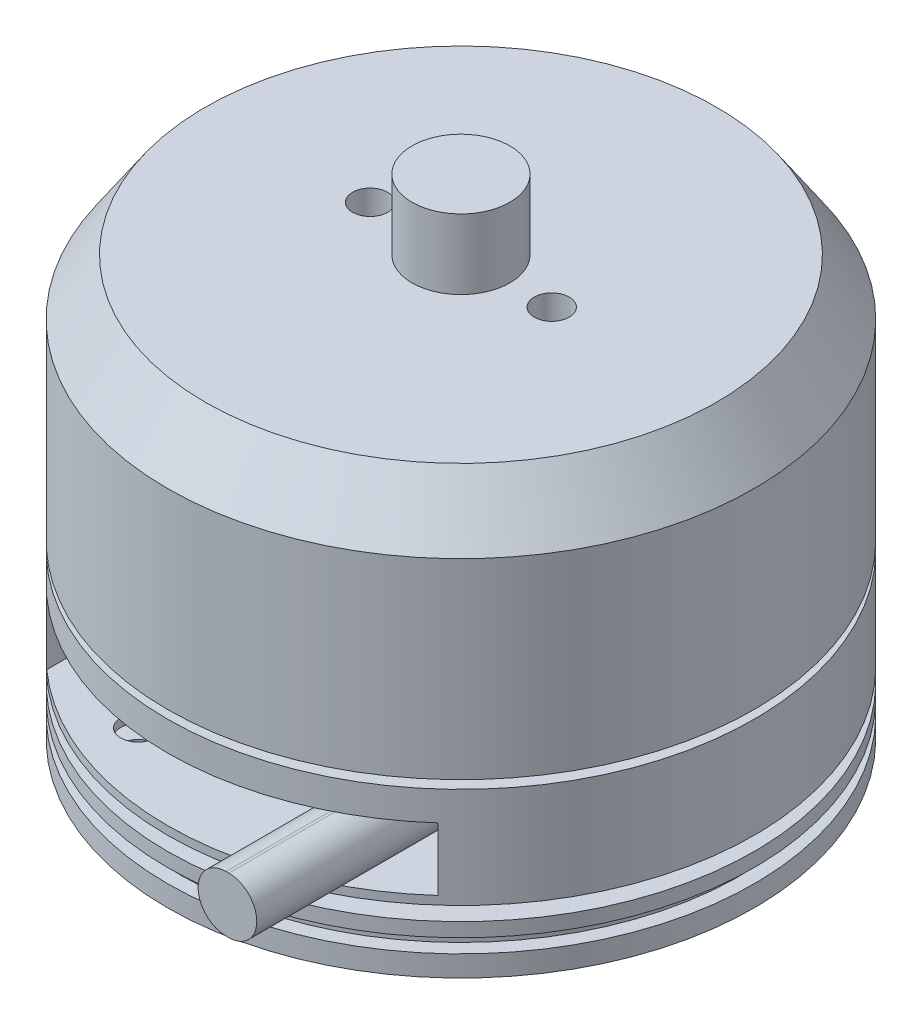
ISO-10303-21;
HEADER;
FILE_DESCRIPTION(('STEP AP214'),'2;1');
FILE_NAME('part.step','',(''),(''),'','','');
FILE_SCHEMA(('AUTOMOTIVE_DESIGN { 1 0 10303 214 1 1 1 1 }'));
ENDSEC;
DATA;
#1=APPLICATION_CONTEXT('core data for automotive mechanical design processes');
#2=APPLICATION_PROTOCOL_DEFINITION('international standard','automotive_design',2000,#1);
#3=PRODUCT_CONTEXT('',#1,'mechanical');
#4=PRODUCT('Part','Part','',(#3));
#5=PRODUCT_RELATED_PRODUCT_CATEGORY('part','',(#4));
#6=PRODUCT_DEFINITION_FORMATION('','',#4);
#7=PRODUCT_DEFINITION_CONTEXT('part definition',#1,'design');
#8=PRODUCT_DEFINITION('design','',#6,#7);
#9=PRODUCT_DEFINITION_SHAPE('','',#8);
#10=(LENGTH_UNIT() NAMED_UNIT(*) SI_UNIT(.MILLI.,.METRE.));
#11=(NAMED_UNIT(*) PLANE_ANGLE_UNIT() SI_UNIT($,.RADIAN.));
#12=(NAMED_UNIT(*) SI_UNIT($,.STERADIAN.) SOLID_ANGLE_UNIT());
#13=UNCERTAINTY_MEASURE_WITH_UNIT(LENGTH_MEASURE(1.E-05),#10,'distance_accuracy_value','');
#14=(GEOMETRIC_REPRESENTATION_CONTEXT(3) GLOBAL_UNCERTAINTY_ASSIGNED_CONTEXT((#13)) GLOBAL_UNIT_ASSIGNED_CONTEXT((#10,
#11,#12)) REPRESENTATION_CONTEXT('',''));
#15=CARTESIAN_POINT('',(0.,0.,0.));
#16=DIRECTION('',(0.,0.,1.));
#17=DIRECTION('',(1.,0.,0.));
#18=AXIS2_PLACEMENT_3D('',#15,#16,#17);
#19=CARTESIAN_POINT('',(0.,0.,11.));
#20=DIRECTION('',(0.,0.,1.));
#21=DIRECTION('',(1.,0.,0.));
#22=AXIS2_PLACEMENT_3D('',#19,#20,#21);
#23=PLANE('',#22);
#24=DIRECTION('',(0.,1.,0.));
#25=VECTOR('',#24,1.);
#26=CARTESIAN_POINT('',(14.,18.3,11.));
#27=LINE('',#26,#25);
#28=CARTESIAN_POINT('',(14.,13.8,11.));
#29=VERTEX_POINT('',#28);
#30=CARTESIAN_POINT('',(14.,18.3,11.));
#31=VERTEX_POINT('',#30);
#32=EDGE_CURVE('E161',#29,#31,#27,.T.);
#33=ORIENTED_EDGE('',*,*,#32,.T.);
#34=DIRECTION('',(-1.,0.,0.));
#35=VECTOR('',#34,1.);
#36=CARTESIAN_POINT('',(-14.,18.3,11.));
#37=LINE('',#36,#35);
#38=CARTESIAN_POINT('',(-14.,18.3,11.));
#39=VERTEX_POINT('',#38);
#40=EDGE_CURVE('E164',#31,#39,#37,.T.);
#41=ORIENTED_EDGE('',*,*,#40,.T.);
#42=DIRECTION('',(0.,-1.,0.));
#43=VECTOR('',#42,1.);
#44=CARTESIAN_POINT('',(-14.,18.3,11.));
#45=LINE('',#44,#43);
#46=CARTESIAN_POINT('',(-14.,13.8,11.));
#47=VERTEX_POINT('',#46);
#48=EDGE_CURVE('E167',#39,#47,#45,.T.);
#49=ORIENTED_EDGE('',*,*,#48,.T.);
#50=DIRECTION('',(1.,0.,0.));
#51=VECTOR('',#50,1.);
#52=CARTESIAN_POINT('',(-14.,13.8,11.));
#53=LINE('',#52,#51);
#54=EDGE_CURVE('E170',#47,#29,#53,.T.);
#55=ORIENTED_EDGE('',*,*,#54,.T.);
#56=EDGE_LOOP('',(#33,#41,#49,#55));
#57=FACE_BOUND('',#56,.T.);
#58=DIRECTION('',(1.,0.,0.));
#59=VECTOR('',#58,1.);
#60=CARTESIAN_POINT('',(9.18505632343501,14.0531944170925,11.));
#61=LINE('',#60,#59);
#62=CARTESIAN_POINT('',(9.18505632343501,14.0531944170925,11.));
#63=VERTEX_POINT('',#62);
#64=CARTESIAN_POINT('',(9.38505632343501,14.0531944170925,11.));
#65=VERTEX_POINT('',#64);
#66=EDGE_CURVE('E148',#63,#65,#61,.T.);
#67=ORIENTED_EDGE('',*,*,#66,.F.);
#68=CARTESIAN_POINT('',(9.18505632343501,16.0531944170925,11.));
#69=DIRECTION('',(0.,0.,1.));
#70=DIRECTION('',(1.,0.,0.));
#71=AXIS2_PLACEMENT_3D('',#68,#69,#70);
#72=CIRCLE('',#71,1.99999999999999);
#73=CARTESIAN_POINT('',(9.18505632343501,18.0531944170925,11.));
#74=VERTEX_POINT('',#73);
#75=EDGE_CURVE('E134',#74,#63,#72,.T.);
#76=ORIENTED_EDGE('',*,*,#75,.F.);
#77=DIRECTION('',(-1.,0.,0.));
#78=VECTOR('',#77,1.);
#79=CARTESIAN_POINT('',(9.18505632343501,18.0531944170925,11.));
#80=LINE('',#79,#78);
#81=CARTESIAN_POINT('',(9.38505632343501,18.0531944170925,11.));
#82=VERTEX_POINT('',#81);
#83=EDGE_CURVE('E139',#82,#74,#80,.T.);
#84=ORIENTED_EDGE('',*,*,#83,.F.);
#85=CARTESIAN_POINT('',(9.38505632343501,16.0531944170925,11.));
#86=DIRECTION('',(0.,0.,1.));
#87=DIRECTION('',(1.,0.,0.));
#88=AXIS2_PLACEMENT_3D('',#85,#86,#87);
#89=CIRCLE('',#88,2.);
#90=EDGE_CURVE('E150',#65,#82,#89,.T.);
#91=ORIENTED_EDGE('',*,*,#90,.F.);
#92=EDGE_LOOP('',(#67,#76,#84,#91));
#93=FACE_BOUND('',#92,.T.);
#94=ADVANCED_FACE('F38',(#57,#93),#23,.T.);
#95=CARTESIAN_POINT('',(0.,43.7,0.));
#96=DIRECTION('',(0.,1.,0.));
#97=DIRECTION('',(0.,0.,1.));
#98=AXIS2_PLACEMENT_3D('',#95,#96,#97);
#99=CYLINDRICAL_SURFACE('',#98,21.);
#100=CARTESIAN_POINT('',(0.,10.2,0.));
#101=DIRECTION('',(0.,1.,0.));
#102=DIRECTION('',(0.,0.,1.));
#103=AXIS2_PLACEMENT_3D('',#100,#101,#102);
#104=CIRCLE('',#103,21.);
#105=CARTESIAN_POINT('',(0.,10.2,21.));
#106=VERTEX_POINT('',#105);
#107=EDGE_CURVE('E228',#106,#106,#104,.T.);
#108=ORIENTED_EDGE('',*,*,#107,.F.);
#109=EDGE_LOOP('',(#108));
#110=FACE_BOUND('',#109,.T.);
#111=CARTESIAN_POINT('',(0.,8.69999999999999,0.));
#112=DIRECTION('',(0.,1.,0.));
#113=DIRECTION('',(0.,0.,1.));
#114=AXIS2_PLACEMENT_3D('',#111,#112,#113);
#115=CIRCLE('',#114,21.);
#116=CARTESIAN_POINT('',(0.,8.69999999999999,21.));
#117=VERTEX_POINT('',#116);
#118=EDGE_CURVE('E42',#117,#117,#115,.T.);
#119=ORIENTED_EDGE('',*,*,#118,.T.);
#120=EDGE_LOOP('',(#119));
#121=FACE_BOUND('',#120,.T.);
#122=ADVANCED_FACE('F40',(#110,#121),#99,.T.);
#123=CARTESIAN_POINT('',(21.,10.2,0.));
#124=DIRECTION('',(0.,-1.,0.));
#125=DIRECTION('',(0.,0.,-1.));
#126=AXIS2_PLACEMENT_3D('',#123,#124,#125);
#127=PLANE('',#126);
#128=CARTESIAN_POINT('',(0.,10.2,0.));
#129=DIRECTION('',(0.,1.,0.));
#130=DIRECTION('',(0.,0.,1.));
#131=AXIS2_PLACEMENT_3D('',#128,#129,#130);
#132=CIRCLE('',#131,20.);
#133=CARTESIAN_POINT('',(0.,10.2,20.));
#134=VERTEX_POINT('',#133);
#135=EDGE_CURVE('E225',#134,#134,#132,.T.);
#136=ORIENTED_EDGE('',*,*,#135,.F.);
#137=EDGE_LOOP('',(#136));
#138=FACE_BOUND('',#137,.T.);
#139=ORIENTED_EDGE('',*,*,#107,.T.);
#140=EDGE_LOOP('',(#139));
#141=FACE_BOUND('',#140,.T.);
#142=ADVANCED_FACE('F351',(#138,#141),#127,.F.);
#143=CARTESIAN_POINT('',(0.,43.7,0.));
#144=DIRECTION('',(0.,1.,0.));
#145=DIRECTION('',(0.,0.,1.));
#146=AXIS2_PLACEMENT_3D('',#143,#144,#145);
#147=CYLINDRICAL_SURFACE('',#146,20.);
#148=CARTESIAN_POINT('',(0.,11.2,0.));
#149=DIRECTION('',(0.,1.,0.));
#150=DIRECTION('',(0.,0.,1.));
#151=AXIS2_PLACEMENT_3D('',#148,#149,#150);
#152=CIRCLE('',#151,20.);
#153=CARTESIAN_POINT('',(0.,11.2,20.));
#154=VERTEX_POINT('',#153);
#155=EDGE_CURVE('E222',#154,#154,#152,.T.);
#156=ORIENTED_EDGE('',*,*,#155,.F.);
#157=EDGE_LOOP('',(#156));
#158=FACE_BOUND('',#157,.T.);
#159=ORIENTED_EDGE('',*,*,#135,.T.);
#160=EDGE_LOOP('',(#159));
#161=FACE_BOUND('',#160,.T.);
#162=ADVANCED_FACE('F345',(#158,#161),#147,.T.);
#163=CARTESIAN_POINT('',(20.,11.2,0.));
#164=DIRECTION('',(0.,1.,0.));
#165=DIRECTION('',(0.,0.,1.));
#166=AXIS2_PLACEMENT_3D('',#163,#164,#165);
#167=PLANE('',#166);
#168=CARTESIAN_POINT('',(0.,11.2,0.));
#169=DIRECTION('',(0.,1.,0.));
#170=DIRECTION('',(0.,0.,1.));
#171=AXIS2_PLACEMENT_3D('',#168,#169,#170);
#172=CIRCLE('',#171,21.);
#173=CARTESIAN_POINT('',(0.,11.2,21.));
#174=VERTEX_POINT('',#173);
#175=EDGE_CURVE('E219',#174,#174,#172,.T.);
#176=ORIENTED_EDGE('',*,*,#175,.F.);
#177=EDGE_LOOP('',(#176));
#178=FACE_BOUND('',#177,.T.);
#179=ORIENTED_EDGE('',*,*,#155,.T.);
#180=EDGE_LOOP('',(#179));
#181=FACE_BOUND('',#180,.T.);
#182=ADVANCED_FACE('F339',(#178,#181),#167,.F.);
#183=CARTESIAN_POINT('',(0.,43.7,0.));
#184=DIRECTION('',(0.,1.,0.));
#185=DIRECTION('',(0.,0.,1.));
#186=AXIS2_PLACEMENT_3D('',#183,#184,#185);
#187=CYLINDRICAL_SURFACE('',#186,21.);
#188=CARTESIAN_POINT('',(0.,12.2,0.));
#189=DIRECTION('',(0.,1.,0.));
#190=DIRECTION('',(0.,0.,1.));
#191=AXIS2_PLACEMENT_3D('',#188,#189,#190);
#192=CIRCLE('',#191,21.);
#193=CARTESIAN_POINT('',(0.,12.2,21.));
#194=VERTEX_POINT('',#193);
#195=EDGE_CURVE('E216',#194,#194,#192,.T.);
#196=ORIENTED_EDGE('',*,*,#195,.F.);
#197=EDGE_LOOP('',(#196));
#198=FACE_BOUND('',#197,.T.);
#199=ORIENTED_EDGE('',*,*,#175,.T.);
#200=EDGE_LOOP('',(#199));
#201=FACE_BOUND('',#200,.T.);
#202=ADVANCED_FACE('F330',(#198,#201),#187,.T.);
#203=CARTESIAN_POINT('',(21.,12.2,0.));
#204=DIRECTION('',(0.,-1.,0.));
#205=DIRECTION('',(0.,0.,-1.));
#206=AXIS2_PLACEMENT_3D('',#203,#204,#205);
#207=PLANE('',#206);
#208=CARTESIAN_POINT('',(-7.1178912538264,12.2,15.9870455087456));
#209=DIRECTION('',(0.,-1.,0.));
#210=DIRECTION('',(0.,0.,-1.));
#211=AXIS2_PLACEMENT_3D('',#208,#209,#210);
#212=CIRCLE('',#211,1.25);
#213=CARTESIAN_POINT('',(-7.1178912538264,12.2,14.7370455087456));
#214=VERTEX_POINT('',#213);
#215=EDGE_CURVE('E252',#214,#214,#212,.T.);
#216=ORIENTED_EDGE('',*,*,#215,.T.);
#217=EDGE_LOOP('',(#216));
#218=FACE_BOUND('',#217,.T.);
#219=CARTESIAN_POINT('',(15.9870455087456,12.2,7.11789125382641));
#220=DIRECTION('',(0.,-1.,0.));
#221=DIRECTION('',(0.,0.,-1.));
#222=AXIS2_PLACEMENT_3D('',#219,#220,#221);
#223=CIRCLE('',#222,1.25);
#224=CARTESIAN_POINT('',(15.9870455087456,12.2,5.86789125382641));
#225=VERTEX_POINT('',#224);
#226=EDGE_CURVE('E261',#225,#225,#223,.T.);
#227=ORIENTED_EDGE('',*,*,#226,.T.);
#228=EDGE_LOOP('',(#227));
#229=FACE_BOUND('',#228,.T.);
#230=CARTESIAN_POINT('',(7.11789125382642,12.2,-15.9870455087456));
#231=DIRECTION('',(0.,-1.,0.));
#232=DIRECTION('',(0.,0.,-1.));
#233=AXIS2_PLACEMENT_3D('',#230,#231,#232);
#234=CIRCLE('',#233,1.25);
#235=CARTESIAN_POINT('',(7.11789125382642,12.2,-17.2370455087456));
#236=VERTEX_POINT('',#235);
#237=EDGE_CURVE('E267',#236,#236,#234,.T.);
#238=ORIENTED_EDGE('',*,*,#237,.T.);
#239=EDGE_LOOP('',(#238));
#240=FACE_BOUND('',#239,.T.);
#241=CARTESIAN_POINT('',(-15.9870455087455,12.2,-7.11789125382641));
#242=DIRECTION('',(0.,-1.,0.));
#243=DIRECTION('',(0.,0.,-1.));
#244=AXIS2_PLACEMENT_3D('',#241,#242,#243);
#245=CIRCLE('',#244,1.25);
#246=CARTESIAN_POINT('',(-15.9870455087455,12.2,-8.36789125382641));
#247=VERTEX_POINT('',#246);
#248=EDGE_CURVE('E273',#247,#247,#245,.T.);
#249=ORIENTED_EDGE('',*,*,#248,.T.);
#250=EDGE_LOOP('',(#249));
#251=FACE_BOUND('',#250,.T.);
#252=CARTESIAN_POINT('',(0.,12.2,0.));
#253=DIRECTION('',(0.,1.,0.));
#254=DIRECTION('',(0.,0.,1.));
#255=AXIS2_PLACEMENT_3D('',#252,#253,#254);
#256=CIRCLE('',#255,10.);
#257=CARTESIAN_POINT('',(0.,12.2,10.));
#258=VERTEX_POINT('',#257);
#259=EDGE_CURVE('E213',#258,#258,#256,.T.);
#260=ORIENTED_EDGE('',*,*,#259,.F.);
#261=EDGE_LOOP('',(#260));
#262=FACE_BOUND('',#261,.T.);
#263=ORIENTED_EDGE('',*,*,#195,.T.);
#264=EDGE_LOOP('',(#263));
#265=FACE_BOUND('',#264,.T.);
#266=ADVANCED_FACE('F326',(#218,#229,#240,#251,#262,#265),#207,.F.);
#267=CARTESIAN_POINT('',(0.,43.7,0.));
#268=DIRECTION('',(0.,1.,0.));
#269=DIRECTION('',(0.,0.,1.));
#270=AXIS2_PLACEMENT_3D('',#267,#268,#269);
#271=CYLINDRICAL_SURFACE('',#270,10.);
#272=CARTESIAN_POINT('',(0.,13.2,0.));
#273=DIRECTION('',(0.,1.,0.));
#274=DIRECTION('',(0.,0.,1.));
#275=AXIS2_PLACEMENT_3D('',#272,#273,#274);
#276=CIRCLE('',#275,10.);
#277=CARTESIAN_POINT('',(0.,13.2,10.));
#278=VERTEX_POINT('',#277);
#279=EDGE_CURVE('E210',#278,#278,#276,.T.);
#280=ORIENTED_EDGE('',*,*,#279,.F.);
#281=EDGE_LOOP('',(#280));
#282=FACE_BOUND('',#281,.T.);
#283=ORIENTED_EDGE('',*,*,#259,.T.);
#284=EDGE_LOOP('',(#283));
#285=FACE_BOUND('',#284,.T.);
#286=ADVANCED_FACE('F329',(#282,#285),#271,.T.);
#287=CARTESIAN_POINT('',(10.,13.2,0.));
#288=DIRECTION('',(0.,1.,0.));
#289=DIRECTION('',(0.,0.,1.));
#290=AXIS2_PLACEMENT_3D('',#287,#288,#289);
#291=PLANE('',#290);
#292=CARTESIAN_POINT('',(-7.1178912538264,13.2,15.9870455087456));
#293=DIRECTION('',(0.,1.,0.));
#294=DIRECTION('',(0.,0.,1.));
#295=AXIS2_PLACEMENT_3D('',#292,#293,#294);
#296=CIRCLE('',#295,1.25);
#297=CARTESIAN_POINT('',(-7.1178912538264,13.2,17.2370455087456));
#298=VERTEX_POINT('',#297);
#299=EDGE_CURVE('E255',#298,#298,#296,.T.);
#300=ORIENTED_EDGE('',*,*,#299,.T.);
#301=EDGE_LOOP('',(#300));
#302=FACE_BOUND('',#301,.T.);
#303=CARTESIAN_POINT('',(15.9870455087456,13.2,7.11789125382641));
#304=DIRECTION('',(0.,1.,0.));
#305=DIRECTION('',(0.,0.,1.));
#306=AXIS2_PLACEMENT_3D('',#303,#304,#305);
#307=CIRCLE('',#306,1.25);
#308=CARTESIAN_POINT('',(15.9870455087456,13.2,8.36789125382641));
#309=VERTEX_POINT('',#308);
#310=EDGE_CURVE('E264',#309,#309,#307,.T.);
#311=ORIENTED_EDGE('',*,*,#310,.T.);
#312=EDGE_LOOP('',(#311));
#313=FACE_BOUND('',#312,.T.);
#314=CARTESIAN_POINT('',(7.11789125382642,13.2,-15.9870455087456));
#315=DIRECTION('',(0.,1.,0.));
#316=DIRECTION('',(0.,0.,1.));
#317=AXIS2_PLACEMENT_3D('',#314,#315,#316);
#318=CIRCLE('',#317,1.25);
#319=CARTESIAN_POINT('',(7.11789125382642,13.2,-14.7370455087455));
#320=VERTEX_POINT('',#319);
#321=EDGE_CURVE('E270',#320,#320,#318,.T.);
#322=ORIENTED_EDGE('',*,*,#321,.T.);
#323=EDGE_LOOP('',(#322));
#324=FACE_BOUND('',#323,.T.);
#325=CARTESIAN_POINT('',(-15.9870455087455,13.2,-7.11789125382641));
#326=DIRECTION('',(0.,1.,0.));
#327=DIRECTION('',(0.,0.,1.));
#328=AXIS2_PLACEMENT_3D('',#325,#326,#327);
#329=CIRCLE('',#328,1.25);
#330=CARTESIAN_POINT('',(-15.9870455087455,13.2,-5.86789125382641));
#331=VERTEX_POINT('',#330);
#332=EDGE_CURVE('E276',#331,#331,#329,.T.);
#333=ORIENTED_EDGE('',*,*,#332,.T.);
#334=EDGE_LOOP('',(#333));
#335=FACE_BOUND('',#334,.T.);
#336=CARTESIAN_POINT('',(0.,13.2,0.));
#337=DIRECTION('',(0.,1.,0.));
#338=DIRECTION('',(0.,0.,1.));
#339=AXIS2_PLACEMENT_3D('',#336,#337,#338);
#340=CIRCLE('',#339,21.);
#341=CARTESIAN_POINT('',(0.,13.2,21.));
#342=VERTEX_POINT('',#341);
#343=EDGE_CURVE('E207',#342,#342,#340,.T.);
#344=ORIENTED_EDGE('',*,*,#343,.F.);
#345=EDGE_LOOP('',(#344));
#346=FACE_BOUND('',#345,.T.);
#347=ORIENTED_EDGE('',*,*,#279,.T.);
#348=EDGE_LOOP('',(#347));
#349=FACE_BOUND('',#348,.T.);
#350=ADVANCED_FACE('F423',(#302,#313,#324,#335,#346,#349),#291,.F.);
#351=CARTESIAN_POINT('',(0.,43.7,0.));
#352=DIRECTION('',(0.,1.,0.));
#353=DIRECTION('',(0.,0.,1.));
#354=AXIS2_PLACEMENT_3D('',#351,#352,#353);
#355=CYLINDRICAL_SURFACE('',#354,21.);
#356=CARTESIAN_POINT('',(0.,18.3,0.));
#357=DIRECTION('',(0.,1.,0.));
#358=DIRECTION('',(0.,0.,1.));
#359=AXIS2_PLACEMENT_3D('',#356,#357,#358);
#360=CIRCLE('',#359,21.);
#361=CARTESIAN_POINT('',(-14.,18.3,15.6524758424985));
#362=VERTEX_POINT('',#361);
#363=CARTESIAN_POINT('',(14.,18.3,15.6524758424985));
#364=VERTEX_POINT('',#363);
#365=EDGE_CURVE('E231',#362,#364,#360,.T.);
#366=ORIENTED_EDGE('',*,*,#365,.T.);
#367=DIRECTION('',(0.,1.,0.));
#368=VECTOR('',#367,1.);
#369=CARTESIAN_POINT('',(14.,43.7,15.6524758424985));
#370=LINE('',#369,#368);
#371=CARTESIAN_POINT('',(14.,13.8,15.6524758424985));
#372=VERTEX_POINT('',#371);
#373=EDGE_CURVE('E236',#364,#372,#370,.F.);
#374=ORIENTED_EDGE('',*,*,#373,.T.);
#375=CARTESIAN_POINT('',(0.,13.8,0.));
#376=DIRECTION('',(0.,-1.,0.));
#377=DIRECTION('',(0.,0.,-1.));
#378=AXIS2_PLACEMENT_3D('',#375,#376,#377);
#379=CIRCLE('',#378,21.);
#380=CARTESIAN_POINT('',(-14.,13.8,15.6524758424985));
#381=VERTEX_POINT('',#380);
#382=EDGE_CURVE('E63',#372,#381,#379,.T.);
#383=ORIENTED_EDGE('',*,*,#382,.T.);
#384=DIRECTION('',(0.,1.,0.));
#385=VECTOR('',#384,1.);
#386=CARTESIAN_POINT('',(-14.,43.7,15.6524758424985));
#387=LINE('',#386,#385);
#388=EDGE_CURVE('E233',#381,#362,#387,.T.);
#389=ORIENTED_EDGE('',*,*,#388,.T.);
#390=EDGE_LOOP('',(#366,#374,#383,#389));
#391=FACE_BOUND('',#390,.T.);
#392=CARTESIAN_POINT('',(0.,20.4,0.));
#393=DIRECTION('',(0.,1.,0.));
#394=DIRECTION('',(0.,0.,1.));
#395=AXIS2_PLACEMENT_3D('',#392,#393,#394);
#396=CIRCLE('',#395,21.);
#397=CARTESIAN_POINT('',(0.,20.4,21.));
#398=VERTEX_POINT('',#397);
#399=EDGE_CURVE('E204',#398,#398,#396,.T.);
#400=ORIENTED_EDGE('',*,*,#399,.F.);
#401=EDGE_LOOP('',(#400));
#402=FACE_BOUND('',#401,.T.);
#403=ORIENTED_EDGE('',*,*,#343,.T.);
#404=EDGE_LOOP('',(#403));
#405=FACE_BOUND('',#404,.T.);
#406=ADVANCED_FACE('F419',(#391,#402,#405),#355,.T.);
#407=CARTESIAN_POINT('',(21.,20.4,0.));
#408=DIRECTION('',(0.,-1.,0.));
#409=DIRECTION('',(0.,0.,-1.));
#410=AXIS2_PLACEMENT_3D('',#407,#408,#409);
#411=PLANE('',#410);
#412=CARTESIAN_POINT('',(0.,20.4,0.));
#413=DIRECTION('',(0.,1.,0.));
#414=DIRECTION('',(0.,0.,1.));
#415=AXIS2_PLACEMENT_3D('',#412,#413,#414);
#416=CIRCLE('',#415,5.);
#417=CARTESIAN_POINT('',(0.,20.4,5.));
#418=VERTEX_POINT('',#417);
#419=EDGE_CURVE('E201',#418,#418,#416,.T.);
#420=ORIENTED_EDGE('',*,*,#419,.F.);
#421=EDGE_LOOP('',(#420));
#422=FACE_BOUND('',#421,.T.);
#423=ORIENTED_EDGE('',*,*,#399,.T.);
#424=EDGE_LOOP('',(#423));
#425=FACE_BOUND('',#424,.T.);
#426=ADVANCED_FACE('F415',(#422,#425),#411,.F.);
#427=CARTESIAN_POINT('',(0.,43.7,0.));
#428=DIRECTION('',(0.,1.,0.));
#429=DIRECTION('',(0.,0.,1.));
#430=AXIS2_PLACEMENT_3D('',#427,#428,#429);
#431=CYLINDRICAL_SURFACE('',#430,5.);
#432=CARTESIAN_POINT('',(0.,21.,0.));
#433=DIRECTION('',(0.,1.,0.));
#434=DIRECTION('',(0.,0.,1.));
#435=AXIS2_PLACEMENT_3D('',#432,#433,#434);
#436=CIRCLE('',#435,5.);
#437=CARTESIAN_POINT('',(0.,21.,5.));
#438=VERTEX_POINT('',#437);
#439=EDGE_CURVE('E198',#438,#438,#436,.T.);
#440=ORIENTED_EDGE('',*,*,#439,.F.);
#441=EDGE_LOOP('',(#440));
#442=FACE_BOUND('',#441,.T.);
#443=ORIENTED_EDGE('',*,*,#419,.T.);
#444=EDGE_LOOP('',(#443));
#445=FACE_BOUND('',#444,.T.);
#446=ADVANCED_FACE('F411',(#442,#445),#431,.T.);
#447=CARTESIAN_POINT('',(5.,21.,0.));
#448=DIRECTION('',(0.,1.,0.));
#449=DIRECTION('',(0.,0.,1.));
#450=AXIS2_PLACEMENT_3D('',#447,#448,#449);
#451=PLANE('',#450);
#452=CARTESIAN_POINT('',(0.,21.,0.));
#453=DIRECTION('',(0.,1.,0.));
#454=DIRECTION('',(0.,0.,1.));
#455=AXIS2_PLACEMENT_3D('',#452,#453,#454);
#456=CIRCLE('',#455,21.);
#457=CARTESIAN_POINT('',(0.,21.,21.));
#458=VERTEX_POINT('',#457);
#459=EDGE_CURVE('E195',#458,#458,#456,.T.);
#460=ORIENTED_EDGE('',*,*,#459,.F.);
#461=EDGE_LOOP('',(#460));
#462=FACE_BOUND('',#461,.T.);
#463=ORIENTED_EDGE('',*,*,#439,.T.);
#464=EDGE_LOOP('',(#463));
#465=FACE_BOUND('',#464,.T.);
#466=ADVANCED_FACE('F407',(#462,#465),#451,.F.);
#467=CARTESIAN_POINT('',(0.,43.7,0.));
#468=DIRECTION('',(0.,1.,0.));
#469=DIRECTION('',(0.,0.,1.));
#470=AXIS2_PLACEMENT_3D('',#467,#468,#469);
#471=CYLINDRICAL_SURFACE('',#470,21.);
#472=CARTESIAN_POINT('',(0.,34.7,0.));
#473=DIRECTION('',(0.,1.,0.));
#474=DIRECTION('',(0.,0.,1.));
#475=AXIS2_PLACEMENT_3D('',#472,#473,#474);
#476=CIRCLE('',#475,21.);
#477=CARTESIAN_POINT('',(0.,34.7,21.));
#478=VERTEX_POINT('',#477);
#479=EDGE_CURVE('E192',#478,#478,#476,.T.);
#480=ORIENTED_EDGE('',*,*,#479,.F.);
#481=EDGE_LOOP('',(#480));
#482=FACE_BOUND('',#481,.T.);
#483=ORIENTED_EDGE('',*,*,#459,.T.);
#484=EDGE_LOOP('',(#483));
#485=FACE_BOUND('',#484,.T.);
#486=ADVANCED_FACE('F403',(#482,#485),#471,.T.);
#487=CARTESIAN_POINT('',(0.,34.7,0.));
#488=DIRECTION('',(0.,-1.,0.));
#489=DIRECTION('',(0.,0.,-1.));
#490=AXIS2_PLACEMENT_3D('',#487,#488,#489);
#491=CONICAL_SURFACE('',#490,21.,0.593749666710772);
#492=CARTESIAN_POINT('',(0.,38.7,0.));
#493=DIRECTION('',(0.,1.,0.));
#494=DIRECTION('',(0.,0.,1.));
#495=AXIS2_PLACEMENT_3D('',#492,#493,#494);
#496=CIRCLE('',#495,18.3);
#497=CARTESIAN_POINT('',(0.,38.7,18.3));
#498=VERTEX_POINT('',#497);
#499=EDGE_CURVE('E189',#498,#498,#496,.T.);
#500=ORIENTED_EDGE('',*,*,#499,.F.);
#501=EDGE_LOOP('',(#500));
#502=FACE_BOUND('',#501,.T.);
#503=ORIENTED_EDGE('',*,*,#479,.T.);
#504=EDGE_LOOP('',(#503));
#505=FACE_BOUND('',#504,.T.);
#506=ADVANCED_FACE('F399',(#502,#505),#491,.T.);
#507=CARTESIAN_POINT('',(18.3,38.7,0.));
#508=DIRECTION('',(0.,-1.,0.));
#509=DIRECTION('',(0.,0.,-1.));
#510=AXIS2_PLACEMENT_3D('',#507,#508,#509);
#511=PLANE('',#510);
#512=CARTESIAN_POINT('',(-6.5,38.7,0.));
#513=DIRECTION('',(0.,1.,0.));
#514=DIRECTION('',(0.,0.,1.));
#515=AXIS2_PLACEMENT_3D('',#512,#513,#514);
#516=CIRCLE('',#515,1.24999999999999);
#517=CARTESIAN_POINT('',(-6.5,38.7,1.24999999999999));
#518=VERTEX_POINT('',#517);
#519=EDGE_CURVE('E122',#518,#518,#516,.T.);
#520=ORIENTED_EDGE('',*,*,#519,.F.);
#521=EDGE_LOOP('',(#520));
#522=FACE_BOUND('',#521,.T.);
#523=CARTESIAN_POINT('',(6.5,38.7,0.));
#524=DIRECTION('',(0.,1.,0.));
#525=DIRECTION('',(0.,0.,1.));
#526=AXIS2_PLACEMENT_3D('',#523,#524,#525);
#527=CIRCLE('',#526,1.24999999999999);
#528=CARTESIAN_POINT('',(6.5,38.7,1.24999999999999));
#529=VERTEX_POINT('',#528);
#530=EDGE_CURVE('E121',#529,#529,#527,.T.);
#531=ORIENTED_EDGE('',*,*,#530,.F.);
#532=EDGE_LOOP('',(#531));
#533=FACE_BOUND('',#532,.T.);
#534=CARTESIAN_POINT('',(0.,38.7,0.));
#535=DIRECTION('',(0.,1.,0.));
#536=DIRECTION('',(0.,0.,1.));
#537=AXIS2_PLACEMENT_3D('',#534,#535,#536);
#538=CIRCLE('',#537,3.5);
#539=CARTESIAN_POINT('',(0.,38.7,3.5));
#540=VERTEX_POINT('',#539);
#541=EDGE_CURVE('E186',#540,#540,#538,.T.);
#542=ORIENTED_EDGE('',*,*,#541,.F.);
#543=EDGE_LOOP('',(#542));
#544=FACE_BOUND('',#543,.T.);
#545=ORIENTED_EDGE('',*,*,#499,.T.);
#546=EDGE_LOOP('',(#545));
#547=FACE_BOUND('',#546,.T.);
#548=ADVANCED_FACE('F395',(#522,#533,#544,#547),#511,.F.);
#549=CARTESIAN_POINT('',(0.,43.7,0.));
#550=DIRECTION('',(0.,1.,0.));
#551=DIRECTION('',(0.,0.,1.));
#552=AXIS2_PLACEMENT_3D('',#549,#550,#551);
#553=CYLINDRICAL_SURFACE('',#552,3.5);
#554=CARTESIAN_POINT('',(0.,43.7,0.));
#555=DIRECTION('',(0.,1.,0.));
#556=DIRECTION('',(0.,0.,1.));
#557=AXIS2_PLACEMENT_3D('',#554,#555,#556);
#558=CIRCLE('',#557,3.5);
#559=CARTESIAN_POINT('',(0.,43.7,3.5));
#560=VERTEX_POINT('',#559);
#561=EDGE_CURVE('E176',#560,#560,#558,.T.);
#562=ORIENTED_EDGE('',*,*,#561,.F.);
#563=EDGE_LOOP('',(#562));
#564=FACE_BOUND('',#563,.T.);
#565=ORIENTED_EDGE('',*,*,#541,.T.);
#566=EDGE_LOOP('',(#565));
#567=FACE_BOUND('',#566,.T.);
#568=ADVANCED_FACE('F391',(#564,#567),#553,.T.);
#569=CARTESIAN_POINT('',(3.5,43.7,0.));
#570=DIRECTION('',(0.,-1.,0.));
#571=DIRECTION('',(0.,0.,-1.));
#572=AXIS2_PLACEMENT_3D('',#569,#570,#571);
#573=PLANE('',#572);
#574=ORIENTED_EDGE('',*,*,#561,.T.);
#575=EDGE_LOOP('',(#574));
#576=FACE_BOUND('',#575,.T.);
#577=ADVANCED_FACE('F387',(#576),#573,.F.);
#578=CARTESIAN_POINT('',(14.,18.3,11.));
#579=DIRECTION('',(1.,0.,0.));
#580=DIRECTION('',(0.,0.,-1.));
#581=AXIS2_PLACEMENT_3D('',#578,#579,#580);
#582=PLANE('',#581);
#583=DIRECTION('',(0.,0.,1.));
#584=VECTOR('',#583,1.);
#585=CARTESIAN_POINT('',(14.,18.3,11.));
#586=LINE('',#585,#584);
#587=EDGE_CURVE('E173',#31,#364,#586,.T.);
#588=ORIENTED_EDGE('',*,*,#587,.F.);
#589=ORIENTED_EDGE('',*,*,#32,.F.);
#590=DIRECTION('',(0.,0.,1.));
#591=VECTOR('',#590,1.);
#592=CARTESIAN_POINT('',(14.,13.8,11.));
#593=LINE('',#592,#591);
#594=EDGE_CURVE('E174',#29,#372,#593,.T.);
#595=ORIENTED_EDGE('',*,*,#594,.T.);
#596=ORIENTED_EDGE('',*,*,#373,.F.);
#597=EDGE_LOOP('',(#588,#589,#595,#596));
#598=FACE_BOUND('',#597,.T.);
#599=ADVANCED_FACE('F376',(#598),#582,.F.);
#600=CARTESIAN_POINT('',(-14.,13.8,11.));
#601=DIRECTION('',(0.,-1.,0.));
#602=DIRECTION('',(0.,0.,-1.));
#603=AXIS2_PLACEMENT_3D('',#600,#601,#602);
#604=PLANE('',#603);
#605=CARTESIAN_POINT('',(-7.1178912538264,13.8,15.9870455087456));
#606=DIRECTION('',(0.,-1.,0.));
#607=DIRECTION('',(0.,0.,-1.));
#608=AXIS2_PLACEMENT_3D('',#605,#606,#607);
#609=CIRCLE('',#608,1.25);
#610=CARTESIAN_POINT('',(-7.1178912538264,13.8,14.7370455087456));
#611=VERTEX_POINT('',#610);
#612=EDGE_CURVE('E258',#611,#611,#609,.T.);
#613=ORIENTED_EDGE('',*,*,#612,.T.);
#614=EDGE_LOOP('',(#613));
#615=FACE_BOUND('',#614,.T.);
#616=ORIENTED_EDGE('',*,*,#594,.F.);
#617=ORIENTED_EDGE('',*,*,#54,.F.);
#618=DIRECTION('',(0.,0.,1.));
#619=VECTOR('',#618,1.);
#620=CARTESIAN_POINT('',(-14.,13.8,11.));
#621=LINE('',#620,#619);
#622=EDGE_CURVE('E177',#47,#381,#621,.T.);
#623=ORIENTED_EDGE('',*,*,#622,.T.);
#624=ORIENTED_EDGE('',*,*,#382,.F.);
#625=EDGE_LOOP('',(#616,#617,#623,#624));
#626=FACE_BOUND('',#625,.T.);
#627=ADVANCED_FACE('F372',(#615,#626),#604,.F.);
#628=CARTESIAN_POINT('',(-14.,18.3,11.));
#629=DIRECTION('',(-1.,0.,0.));
#630=DIRECTION('',(0.,-1.,0.));
#631=AXIS2_PLACEMENT_3D('',#628,#629,#630);
#632=PLANE('',#631);
#633=ORIENTED_EDGE('',*,*,#622,.F.);
#634=ORIENTED_EDGE('',*,*,#48,.F.);
#635=DIRECTION('',(0.,0.,1.));
#636=VECTOR('',#635,1.);
#637=CARTESIAN_POINT('',(-14.,18.3,11.));
#638=LINE('',#637,#636);
#639=EDGE_CURVE('E179',#39,#362,#638,.T.);
#640=ORIENTED_EDGE('',*,*,#639,.T.);
#641=ORIENTED_EDGE('',*,*,#388,.F.);
#642=EDGE_LOOP('',(#633,#634,#640,#641));
#643=FACE_BOUND('',#642,.T.);
#644=ADVANCED_FACE('F375',(#643),#632,.F.);
#645=CARTESIAN_POINT('',(-14.,18.3,11.));
#646=DIRECTION('',(0.,1.,0.));
#647=DIRECTION('',(0.,0.,1.));
#648=AXIS2_PLACEMENT_3D('',#645,#646,#647);
#649=PLANE('',#648);
#650=ORIENTED_EDGE('',*,*,#365,.F.);
#651=ORIENTED_EDGE('',*,*,#639,.F.);
#652=ORIENTED_EDGE('',*,*,#40,.F.);
#653=ORIENTED_EDGE('',*,*,#587,.T.);
#654=EDGE_LOOP('',(#650,#651,#652,#653));
#655=FACE_BOUND('',#654,.T.);
#656=ADVANCED_FACE('F380',(#655),#649,.F.);
#657=CARTESIAN_POINT('',(9.18505632343501,16.0531944170925,26.));
#658=DIRECTION('',(0.,0.,-1.));
#659=DIRECTION('',(-1.,0.,0.));
#660=AXIS2_PLACEMENT_3D('',#657,#658,#659);
#661=CYLINDRICAL_SURFACE('',#660,1.99999999999999);
#662=ORIENTED_EDGE('',*,*,#75,.T.);
#663=DIRECTION('',(0.,0.,-1.));
#664=VECTOR('',#663,1.);
#665=CARTESIAN_POINT('',(9.18505632343501,14.0531944170925,26.));
#666=LINE('',#665,#664);
#667=CARTESIAN_POINT('',(9.18505632343501,14.0531944170925,26.));
#668=VERTEX_POINT('',#667);
#669=EDGE_CURVE('E159',#668,#63,#666,.T.);
#670=ORIENTED_EDGE('',*,*,#669,.F.);
#671=CARTESIAN_POINT('',(9.18505632343501,16.0531944170925,26.));
#672=DIRECTION('',(0.,0.,1.));
#673=DIRECTION('',(1.,0.,0.));
#674=AXIS2_PLACEMENT_3D('',#671,#672,#673);
#675=CIRCLE('',#674,1.99999999999999);
#676=CARTESIAN_POINT('',(9.18505632343501,18.0531944170925,26.));
#677=VERTEX_POINT('',#676);
#678=EDGE_CURVE('E135',#677,#668,#675,.T.);
#679=ORIENTED_EDGE('',*,*,#678,.F.);
#680=DIRECTION('',(0.,0.,-1.));
#681=VECTOR('',#680,1.);
#682=CARTESIAN_POINT('',(9.18505632343501,18.0531944170925,26.));
#683=LINE('',#682,#681);
#684=EDGE_CURVE('E145',#677,#74,#683,.T.);
#685=ORIENTED_EDGE('',*,*,#684,.T.);
#686=EDGE_LOOP('',(#662,#670,#679,#685));
#687=FACE_BOUND('',#686,.T.);
#688=ADVANCED_FACE('F370',(#687),#661,.T.);
#689=CARTESIAN_POINT('',(9.18505632343501,14.0531944170925,26.));
#690=DIRECTION('',(0.,1.,0.));
#691=DIRECTION('',(-1.,0.,0.));
#692=AXIS2_PLACEMENT_3D('',#689,#690,#691);
#693=PLANE('',#692);
#694=ORIENTED_EDGE('',*,*,#66,.T.);
#695=DIRECTION('',(0.,0.,-1.));
#696=VECTOR('',#695,1.);
#697=CARTESIAN_POINT('',(9.38505632343501,14.0531944170925,26.));
#698=LINE('',#697,#696);
#699=CARTESIAN_POINT('',(9.38505632343501,14.0531944170925,26.));
#700=VERTEX_POINT('',#699);
#701=EDGE_CURVE('E156',#700,#65,#698,.T.);
#702=ORIENTED_EDGE('',*,*,#701,.F.);
#703=DIRECTION('',(1.,0.,0.));
#704=VECTOR('',#703,1.);
#705=CARTESIAN_POINT('',(9.18505632343501,14.0531944170925,26.));
#706=LINE('',#705,#704);
#707=EDGE_CURVE('E138',#668,#700,#706,.T.);
#708=ORIENTED_EDGE('',*,*,#707,.F.);
#709=ORIENTED_EDGE('',*,*,#669,.T.);
#710=EDGE_LOOP('',(#694,#702,#708,#709));
#711=FACE_BOUND('',#710,.T.);
#712=ADVANCED_FACE('F503',(#711),#693,.F.);
#713=CARTESIAN_POINT('',(9.38505632343501,16.0531944170925,26.));
#714=DIRECTION('',(0.,0.,-1.));
#715=DIRECTION('',(-1.,0.,0.));
#716=AXIS2_PLACEMENT_3D('',#713,#714,#715);
#717=CYLINDRICAL_SURFACE('',#716,2.);
#718=ORIENTED_EDGE('',*,*,#90,.T.);
#719=DIRECTION('',(0.,0.,-1.));
#720=VECTOR('',#719,1.);
#721=CARTESIAN_POINT('',(9.38505632343501,18.0531944170925,26.));
#722=LINE('',#721,#720);
#723=CARTESIAN_POINT('',(9.38505632343501,18.0531944170925,26.));
#724=VERTEX_POINT('',#723);
#725=EDGE_CURVE('E55',#724,#82,#722,.T.);
#726=ORIENTED_EDGE('',*,*,#725,.F.);
#727=CARTESIAN_POINT('',(9.38505632343501,16.0531944170925,26.));
#728=DIRECTION('',(0.,0.,1.));
#729=DIRECTION('',(1.,0.,0.));
#730=AXIS2_PLACEMENT_3D('',#727,#728,#729);
#731=CIRCLE('',#730,2.);
#732=EDGE_CURVE('E141',#700,#724,#731,.T.);
#733=ORIENTED_EDGE('',*,*,#732,.F.);
#734=ORIENTED_EDGE('',*,*,#701,.T.);
#735=EDGE_LOOP('',(#718,#726,#733,#734));
#736=FACE_BOUND('',#735,.T.);
#737=ADVANCED_FACE('F510',(#736),#717,.T.);
#738=CARTESIAN_POINT('',(9.18505632343501,18.0531944170925,26.));
#739=DIRECTION('',(0.,-1.,0.));
#740=DIRECTION('',(1.,0.,0.));
#741=AXIS2_PLACEMENT_3D('',#738,#739,#740);
#742=PLANE('',#741);
#743=ORIENTED_EDGE('',*,*,#83,.T.);
#744=ORIENTED_EDGE('',*,*,#684,.F.);
#745=DIRECTION('',(-1.,0.,0.));
#746=VECTOR('',#745,1.);
#747=CARTESIAN_POINT('',(9.18505632343501,18.0531944170925,26.));
#748=LINE('',#747,#746);
#749=EDGE_CURVE('E143',#724,#677,#748,.T.);
#750=ORIENTED_EDGE('',*,*,#749,.F.);
#751=ORIENTED_EDGE('',*,*,#725,.T.);
#752=EDGE_LOOP('',(#743,#744,#750,#751));
#753=FACE_BOUND('',#752,.T.);
#754=ADVANCED_FACE('F517',(#753),#742,.F.);
#755=CARTESIAN_POINT('',(9.18505632343501,16.0531944170925,26.));
#756=DIRECTION('',(0.,0.,1.));
#757=DIRECTION('',(1.,0.,0.));
#758=AXIS2_PLACEMENT_3D('',#755,#756,#757);
#759=PLANE('',#758);
#760=ORIENTED_EDGE('',*,*,#678,.T.);
#761=ORIENTED_EDGE('',*,*,#707,.T.);
#762=ORIENTED_EDGE('',*,*,#732,.T.);
#763=ORIENTED_EDGE('',*,*,#749,.T.);
#764=EDGE_LOOP('',(#760,#761,#762,#763));
#765=FACE_BOUND('',#764,.T.);
#766=ADVANCED_FACE('F525',(#765),#759,.T.);
#767=CARTESIAN_POINT('',(6.5,34.7,0.));
#768=DIRECTION('',(0.,1.,0.));
#769=DIRECTION('',(0.,0.,1.));
#770=AXIS2_PLACEMENT_3D('',#767,#768,#769);
#771=CONICAL_SURFACE('',#770,1.25,1.02974425867665);
#772=CARTESIAN_POINT('',(6.5,33.9489242262155,0.));
#773=VERTEX_POINT('',#772);
#774=VERTEX_LOOP('',#773);
#775=FACE_BOUND('',#774,.T.);
#776=CARTESIAN_POINT('',(6.5,34.7,0.));
#777=DIRECTION('',(0.,1.,0.));
#778=DIRECTION('',(0.,0.,1.));
#779=AXIS2_PLACEMENT_3D('',#776,#777,#778);
#780=CIRCLE('',#779,1.25);
#781=CARTESIAN_POINT('',(6.5,34.7,1.25));
#782=VERTEX_POINT('',#781);
#783=EDGE_CURVE('E125',#782,#782,#780,.T.);
#784=ORIENTED_EDGE('',*,*,#783,.T.);
#785=EDGE_LOOP('',(#784));
#786=FACE_BOUND('',#785,.T.);
#787=ADVANCED_FACE('F531',(#775,#786),#771,.F.);
#788=CARTESIAN_POINT('',(6.5,38.7,0.));
#789=DIRECTION('',(0.,1.,0.));
#790=DIRECTION('',(0.,0.,1.));
#791=AXIS2_PLACEMENT_3D('',#788,#789,#790);
#792=CYLINDRICAL_SURFACE('',#791,1.24999999999999);
#793=ORIENTED_EDGE('',*,*,#783,.F.);
#794=EDGE_LOOP('',(#793));
#795=FACE_BOUND('',#794,.T.);
#796=ORIENTED_EDGE('',*,*,#530,.T.);
#797=EDGE_LOOP('',(#796));
#798=FACE_BOUND('',#797,.T.);
#799=ADVANCED_FACE('F115',(#795,#798),#792,.F.);
#800=CARTESIAN_POINT('',(-6.5,34.7,0.));
#801=DIRECTION('',(0.,1.,0.));
#802=DIRECTION('',(0.,0.,1.));
#803=AXIS2_PLACEMENT_3D('',#800,#801,#802);
#804=CONICAL_SURFACE('',#803,1.25,1.02974425867665);
#805=CARTESIAN_POINT('',(-6.5,33.9489242262155,0.));
#806=VERTEX_POINT('',#805);
#807=VERTEX_LOOP('',#806);
#808=FACE_BOUND('',#807,.T.);
#809=CARTESIAN_POINT('',(-6.5,34.7,0.));
#810=DIRECTION('',(0.,1.,0.));
#811=DIRECTION('',(0.,0.,1.));
#812=AXIS2_PLACEMENT_3D('',#809,#810,#811);
#813=CIRCLE('',#812,1.25);
#814=CARTESIAN_POINT('',(-6.5,34.7,1.25));
#815=VERTEX_POINT('',#814);
#816=EDGE_CURVE('E119',#815,#815,#813,.T.);
#817=ORIENTED_EDGE('',*,*,#816,.T.);
#818=EDGE_LOOP('',(#817));
#819=FACE_BOUND('',#818,.T.);
#820=ADVANCED_FACE('F111',(#808,#819),#804,.F.);
#821=CARTESIAN_POINT('',(-6.5,38.7,0.));
#822=DIRECTION('',(0.,1.,0.));
#823=DIRECTION('',(0.,0.,1.));
#824=AXIS2_PLACEMENT_3D('',#821,#822,#823);
#825=CYLINDRICAL_SURFACE('',#824,1.24999999999999);
#826=ORIENTED_EDGE('',*,*,#816,.F.);
#827=EDGE_LOOP('',(#826));
#828=FACE_BOUND('',#827,.T.);
#829=ORIENTED_EDGE('',*,*,#519,.T.);
#830=EDGE_LOOP('',(#829));
#831=FACE_BOUND('',#830,.T.);
#832=ADVANCED_FACE('F114',(#828,#831),#825,.F.);
#833=CARTESIAN_POINT('',(-21.,8.69999999999999,35.0948557545511));
#834=DIRECTION('',(0.,1.,0.));
#835=DIRECTION('',(0.,0.,1.));
#836=AXIS2_PLACEMENT_3D('',#833,#834,#835);
#837=PLANE('',#836);
#838=CARTESIAN_POINT('',(-7.1178912538264,8.69999999999999,15.9870455087456));
#839=DIRECTION('',(0.,-1.,0.));
#840=DIRECTION('',(0.,0.,-1.));
#841=AXIS2_PLACEMENT_3D('',#838,#839,#840);
#842=CIRCLE('',#841,1.25);
#843=CARTESIAN_POINT('',(-7.1178912538264,8.69999999999999,14.7370455087456));
#844=VERTEX_POINT('',#843);
#845=EDGE_CURVE('E279',#844,#844,#842,.T.);
#846=ORIENTED_EDGE('',*,*,#845,.F.);
#847=EDGE_LOOP('',(#846));
#848=FACE_BOUND('',#847,.T.);
#849=CARTESIAN_POINT('',(15.9870455087456,8.69999999999999,7.11789125382641));
#850=DIRECTION('',(0.,-1.,0.));
#851=DIRECTION('',(0.,0.,-1.));
#852=AXIS2_PLACEMENT_3D('',#849,#850,#851);
#853=CIRCLE('',#852,1.25);
#854=CARTESIAN_POINT('',(15.9870455087456,8.69999999999999,5.86789125382641));
#855=VERTEX_POINT('',#854);
#856=EDGE_CURVE('E292',#855,#855,#853,.T.);
#857=ORIENTED_EDGE('',*,*,#856,.F.);
#858=EDGE_LOOP('',(#857));
#859=FACE_BOUND('',#858,.T.);
#860=CARTESIAN_POINT('',(7.11789125382642,8.69999999999999,-15.9870455087456));
#861=DIRECTION('',(0.,-1.,0.));
#862=DIRECTION('',(0.,0.,-1.));
#863=AXIS2_PLACEMENT_3D('',#860,#861,#862);
#864=CIRCLE('',#863,1.25);
#865=CARTESIAN_POINT('',(7.11789125382642,8.69999999999999,-17.2370455087456));
#866=VERTEX_POINT('',#865);
#867=EDGE_CURVE('E286',#866,#866,#864,.T.);
#868=ORIENTED_EDGE('',*,*,#867,.F.);
#869=EDGE_LOOP('',(#868));
#870=FACE_BOUND('',#869,.T.);
#871=CARTESIAN_POINT('',(-15.9870455087455,8.69999999999999,-7.11789125382641));
#872=DIRECTION('',(0.,-1.,0.));
#873=DIRECTION('',(0.,0.,-1.));
#874=AXIS2_PLACEMENT_3D('',#871,#872,#873);
#875=CIRCLE('',#874,1.25);
#876=CARTESIAN_POINT('',(-15.9870455087455,8.69999999999999,-8.36789125382641));
#877=VERTEX_POINT('',#876);
#878=EDGE_CURVE('E280',#877,#877,#875,.T.);
#879=ORIENTED_EDGE('',*,*,#878,.F.);
#880=EDGE_LOOP('',(#879));
#881=FACE_BOUND('',#880,.T.);
#882=CARTESIAN_POINT('',(0.,8.69999999999999,0.));
#883=DIRECTION('',(0.,-1.,0.));
#884=DIRECTION('',(0.,0.,-1.));
#885=AXIS2_PLACEMENT_3D('',#882,#883,#884);
#886=CIRCLE('',#885,13.4);
#887=CARTESIAN_POINT('',(0.,8.69999999999999,-13.4));
#888=VERTEX_POINT('',#887);
#889=EDGE_CURVE('E47',#888,#888,#886,.T.);
#890=ORIENTED_EDGE('',*,*,#889,.F.);
#891=EDGE_LOOP('',(#890));
#892=FACE_BOUND('',#891,.T.);
#893=ORIENTED_EDGE('',*,*,#118,.F.);
#894=EDGE_LOOP('',(#893));
#895=FACE_BOUND('',#894,.T.);
#896=ADVANCED_FACE('F304',(#848,#859,#870,#881,#892,#895),#837,.F.);
#897=CARTESIAN_POINT('',(0.,6.69999999999999,0.));
#898=DIRECTION('',(0.,1.,0.));
#899=DIRECTION('',(0.,0.,1.));
#900=AXIS2_PLACEMENT_3D('',#897,#898,#899);
#901=CYLINDRICAL_SURFACE('',#900,13.4);
#902=CARTESIAN_POINT('',(0.,6.69999999999999,0.));
#903=DIRECTION('',(0.,-1.,0.));
#904=DIRECTION('',(0.,0.,-1.));
#905=AXIS2_PLACEMENT_3D('',#902,#903,#904);
#906=CIRCLE('',#905,13.4);
#907=CARTESIAN_POINT('',(0.,6.69999999999999,-13.4));
#908=VERTEX_POINT('',#907);
#909=EDGE_CURVE('E128',#908,#908,#906,.T.);
#910=ORIENTED_EDGE('',*,*,#909,.F.);
#911=EDGE_LOOP('',(#910));
#912=FACE_BOUND('',#911,.T.);
#913=ORIENTED_EDGE('',*,*,#889,.T.);
#914=EDGE_LOOP('',(#913));
#915=FACE_BOUND('',#914,.T.);
#916=ADVANCED_FACE('F307',(#912,#915),#901,.T.);
#917=CARTESIAN_POINT('',(0.,6.69999999999999,0.));
#918=DIRECTION('',(0.,-1.,0.));
#919=DIRECTION('',(0.,0.,-1.));
#920=AXIS2_PLACEMENT_3D('',#917,#918,#919);
#921=PLANE('',#920);
#922=CARTESIAN_POINT('',(0.,6.69999999999999,0.));
#923=DIRECTION('',(0.,-1.,0.));
#924=DIRECTION('',(0.,0.,-1.));
#925=AXIS2_PLACEMENT_3D('',#922,#923,#924);
#926=CIRCLE('',#925,5.75);
#927=CARTESIAN_POINT('',(0.,6.69999999999999,-5.75));
#928=VERTEX_POINT('',#927);
#929=EDGE_CURVE('E11',#928,#928,#926,.T.);
#930=ORIENTED_EDGE('',*,*,#929,.F.);
#931=EDGE_LOOP('',(#930));
#932=FACE_BOUND('',#931,.T.);
#933=ORIENTED_EDGE('',*,*,#909,.T.);
#934=EDGE_LOOP('',(#933));
#935=FACE_BOUND('',#934,.T.);
#936=ADVANCED_FACE('F566',(#932,#935),#921,.T.);
#937=CARTESIAN_POINT('',(0.,0.,0.));
#938=DIRECTION('',(0.,1.,0.));
#939=DIRECTION('',(0.,0.,1.));
#940=AXIS2_PLACEMENT_3D('',#937,#938,#939);
#941=CYLINDRICAL_SURFACE('',#940,5.75);
#942=CARTESIAN_POINT('',(0.,0.,0.));
#943=DIRECTION('',(0.,-1.,0.));
#944=DIRECTION('',(0.,0.,-1.));
#945=AXIS2_PLACEMENT_3D('',#942,#943,#944);
#946=CIRCLE('',#945,5.75);
#947=CARTESIAN_POINT('',(0.,0.,-5.75));
#948=VERTEX_POINT('',#947);
#949=EDGE_CURVE('E248',#948,#948,#946,.T.);
#950=ORIENTED_EDGE('',*,*,#949,.F.);
#951=EDGE_LOOP('',(#950));
#952=FACE_BOUND('',#951,.T.);
#953=ORIENTED_EDGE('',*,*,#929,.T.);
#954=EDGE_LOOP('',(#953));
#955=FACE_BOUND('',#954,.T.);
#956=ADVANCED_FACE('F574',(#952,#955),#941,.T.);
#957=CARTESIAN_POINT('',(0.,0.,0.));
#958=DIRECTION('',(0.,-1.,0.));
#959=DIRECTION('',(0.,0.,-1.));
#960=AXIS2_PLACEMENT_3D('',#957,#958,#959);
#961=PLANE('',#960);
#962=ORIENTED_EDGE('',*,*,#949,.T.);
#963=EDGE_LOOP('',(#962));
#964=FACE_BOUND('',#963,.T.);
#965=ADVANCED_FACE('F321',(#964),#961,.T.);
#966=CARTESIAN_POINT('',(-15.9870455087455,16.7,-7.11789125382641));
#967=DIRECTION('',(0.,-1.,0.));
#968=DIRECTION('',(0.,0.,-1.));
#969=AXIS2_PLACEMENT_3D('',#966,#967,#968);
#970=CYLINDRICAL_SURFACE('',#969,1.25);
#971=ORIENTED_EDGE('',*,*,#878,.T.);
#972=EDGE_LOOP('',(#971));
#973=FACE_BOUND('',#972,.T.);
#974=ORIENTED_EDGE('',*,*,#248,.F.);
#975=EDGE_LOOP('',(#974));
#976=FACE_BOUND('',#975,.T.);
#977=ADVANCED_FACE('F317',(#973,#976),#970,.F.);
#978=CARTESIAN_POINT('',(7.11789125382642,16.7,-15.9870455087456));
#979=DIRECTION('',(0.,-1.,0.));
#980=DIRECTION('',(0.,0.,-1.));
#981=AXIS2_PLACEMENT_3D('',#978,#979,#980);
#982=CYLINDRICAL_SURFACE('',#981,1.25);
#983=ORIENTED_EDGE('',*,*,#867,.T.);
#984=EDGE_LOOP('',(#983));
#985=FACE_BOUND('',#984,.T.);
#986=ORIENTED_EDGE('',*,*,#237,.F.);
#987=EDGE_LOOP('',(#986));
#988=FACE_BOUND('',#987,.T.);
#989=ADVANCED_FACE('F320',(#985,#988),#982,.F.);
#990=CARTESIAN_POINT('',(15.9870455087456,16.7,7.11789125382641));
#991=DIRECTION('',(0.,-1.,0.));
#992=DIRECTION('',(0.,0.,-1.));
#993=AXIS2_PLACEMENT_3D('',#990,#991,#992);
#994=CYLINDRICAL_SURFACE('',#993,1.25);
#995=ORIENTED_EDGE('',*,*,#856,.T.);
#996=EDGE_LOOP('',(#995));
#997=FACE_BOUND('',#996,.T.);
#998=ORIENTED_EDGE('',*,*,#226,.F.);
#999=EDGE_LOOP('',(#998));
#1000=FACE_BOUND('',#999,.T.);
#1001=ADVANCED_FACE('F601',(#997,#1000),#994,.F.);
#1002=CARTESIAN_POINT('',(-7.1178912538264,16.7,15.9870455087456));
#1003=DIRECTION('',(0.,-1.,0.));
#1004=DIRECTION('',(0.,0.,-1.));
#1005=AXIS2_PLACEMENT_3D('',#1002,#1003,#1004);
#1006=CYLINDRICAL_SURFACE('',#1005,1.25);
#1007=ORIENTED_EDGE('',*,*,#845,.T.);
#1008=EDGE_LOOP('',(#1007));
#1009=FACE_BOUND('',#1008,.T.);
#1010=ORIENTED_EDGE('',*,*,#215,.F.);
#1011=EDGE_LOOP('',(#1010));
#1012=FACE_BOUND('',#1011,.T.);
#1013=ADVANCED_FACE('F301',(#1009,#1012),#1006,.F.);
#1014=ORIENTED_EDGE('',*,*,#612,.F.);
#1015=EDGE_LOOP('',(#1014));
#1016=FACE_BOUND('',#1015,.T.);
#1017=ORIENTED_EDGE('',*,*,#299,.F.);
#1018=EDGE_LOOP('',(#1017));
#1019=FACE_BOUND('',#1018,.T.);
#1020=ADVANCED_FACE('F619',(#1016,#1019),#1006,.F.);
#1021=CARTESIAN_POINT('',(-15.9870455087455,16.7,-7.11789125382641));
#1022=DIRECTION('',(0.,-1.,0.));
#1023=DIRECTION('',(0.,0.,-1.));
#1024=AXIS2_PLACEMENT_3D('',#1021,#1022,#1023);
#1025=CIRCLE('',#1024,1.25);
#1026=CARTESIAN_POINT('',(-15.9870455087455,16.7,-8.36789125382641));
#1027=VERTEX_POINT('',#1026);
#1028=EDGE_CURVE('E283',#1027,#1027,#1025,.T.);
#1029=ORIENTED_EDGE('',*,*,#1028,.F.);
#1030=EDGE_LOOP('',(#1029));
#1031=FACE_BOUND('',#1030,.T.);
#1032=ORIENTED_EDGE('',*,*,#332,.F.);
#1033=EDGE_LOOP('',(#1032));
#1034=FACE_BOUND('',#1033,.T.);
#1035=ADVANCED_FACE('F323',(#1031,#1034),#970,.F.);
#1036=CARTESIAN_POINT('',(-15.9870455087455,16.7,-7.11789125382641));
#1037=DIRECTION('',(0.,-1.,0.));
#1038=DIRECTION('',(0.,0.,-1.));
#1039=AXIS2_PLACEMENT_3D('',#1036,#1037,#1038);
#1040=PLANE('',#1039);
#1041=ORIENTED_EDGE('',*,*,#1028,.T.);
#1042=EDGE_LOOP('',(#1041));
#1043=FACE_BOUND('',#1042,.T.);
#1044=ADVANCED_FACE('F631',(#1043),#1040,.T.);
#1045=CARTESIAN_POINT('',(7.11789125382642,16.7,-15.9870455087456));
#1046=DIRECTION('',(0.,-1.,0.));
#1047=DIRECTION('',(0.,0.,-1.));
#1048=AXIS2_PLACEMENT_3D('',#1045,#1046,#1047);
#1049=CIRCLE('',#1048,1.25);
#1050=CARTESIAN_POINT('',(7.11789125382642,16.7,-17.2370455087456));
#1051=VERTEX_POINT('',#1050);
#1052=EDGE_CURVE('E289',#1051,#1051,#1049,.T.);
#1053=ORIENTED_EDGE('',*,*,#1052,.F.);
#1054=EDGE_LOOP('',(#1053));
#1055=FACE_BOUND('',#1054,.T.);
#1056=ORIENTED_EDGE('',*,*,#321,.F.);
#1057=EDGE_LOOP('',(#1056));
#1058=FACE_BOUND('',#1057,.T.);
#1059=ADVANCED_FACE('F604',(#1055,#1058),#982,.F.);
#1060=CARTESIAN_POINT('',(7.11789125382642,16.7,-15.9870455087456));
#1061=DIRECTION('',(0.,-1.,0.));
#1062=DIRECTION('',(0.,0.,-1.));
#1063=AXIS2_PLACEMENT_3D('',#1060,#1061,#1062);
#1064=PLANE('',#1063);
#1065=ORIENTED_EDGE('',*,*,#1052,.T.);
#1066=EDGE_LOOP('',(#1065));
#1067=FACE_BOUND('',#1066,.T.);
#1068=ADVANCED_FACE('F645',(#1067),#1064,.T.);
#1069=CARTESIAN_POINT('',(15.9870455087456,16.7,7.11789125382641));
#1070=DIRECTION('',(0.,-1.,0.));
#1071=DIRECTION('',(0.,0.,-1.));
#1072=AXIS2_PLACEMENT_3D('',#1069,#1070,#1071);
#1073=CIRCLE('',#1072,1.25);
#1074=CARTESIAN_POINT('',(15.9870455087456,16.7,5.86789125382641));
#1075=VERTEX_POINT('',#1074);
#1076=EDGE_CURVE('E295',#1075,#1075,#1073,.T.);
#1077=ORIENTED_EDGE('',*,*,#1076,.F.);
#1078=EDGE_LOOP('',(#1077));
#1079=FACE_BOUND('',#1078,.T.);
#1080=ORIENTED_EDGE('',*,*,#310,.F.);
#1081=EDGE_LOOP('',(#1080));
#1082=FACE_BOUND('',#1081,.T.);
#1083=ADVANCED_FACE('F613',(#1079,#1082),#994,.F.);
#1084=CARTESIAN_POINT('',(15.9870455087456,16.7,7.11789125382641));
#1085=DIRECTION('',(0.,-1.,0.));
#1086=DIRECTION('',(0.,0.,-1.));
#1087=AXIS2_PLACEMENT_3D('',#1084,#1085,#1086);
#1088=PLANE('',#1087);
#1089=ORIENTED_EDGE('',*,*,#1076,.T.);
#1090=EDGE_LOOP('',(#1089));
#1091=FACE_BOUND('',#1090,.T.);
#1092=ADVANCED_FACE('F658',(#1091),#1088,.T.);
#1093=CLOSED_SHELL('',(#94,#122,#142,#162,#182,#202,#266,#286,#350,#406,#426,#446,#466,#486,
#506,#548,#568,#577,#599,#627,#644,#656,#688,#712,#737,#754,#766,#787,#799,#820,#832,#896,#916,
#936,#956,#965,#977,#989,#1001,#1013,#1020,#1035,#1044,#1059,#1068,#1083,#1092));
#1094=MANIFOLD_SOLID_BREP('B2',#1093);
#1095=ADVANCED_BREP_SHAPE_REPRESENTATION('',(#18,#1094),#14);
#1096=SHAPE_DEFINITION_REPRESENTATION(#9,#1095);
ENDSEC;
END-ISO-10303-21;
